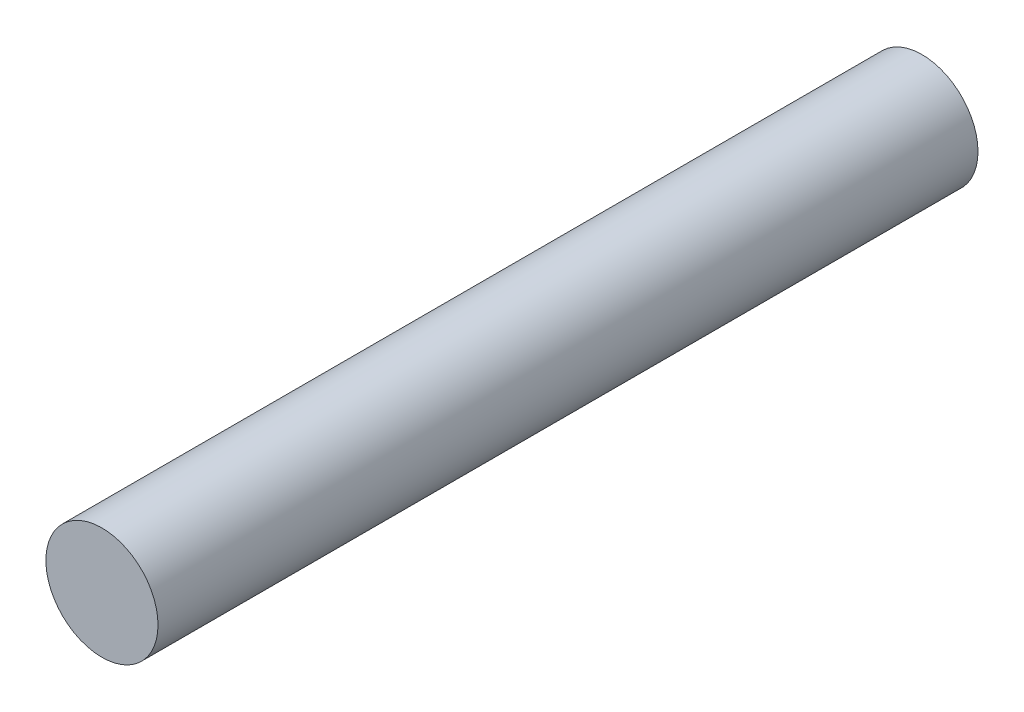
ISO-10303-21;
HEADER;
FILE_DESCRIPTION(('STEP AP214'),'2;1');
FILE_NAME('part.step','',(''),(''),'','','');
FILE_SCHEMA(('AUTOMOTIVE_DESIGN { 1 0 10303 214 1 1 1 1 }'));
ENDSEC;
DATA;
#1=APPLICATION_CONTEXT('core data for automotive mechanical design processes');
#2=APPLICATION_PROTOCOL_DEFINITION('international standard','automotive_design',2000,#1);
#3=PRODUCT_CONTEXT('',#1,'mechanical');
#4=PRODUCT('Part','Part','',(#3));
#5=PRODUCT_RELATED_PRODUCT_CATEGORY('part','',(#4));
#6=PRODUCT_DEFINITION_FORMATION('','',#4);
#7=PRODUCT_DEFINITION_CONTEXT('part definition',#1,'design');
#8=PRODUCT_DEFINITION('design','',#6,#7);
#9=PRODUCT_DEFINITION_SHAPE('','',#8);
#10=(LENGTH_UNIT() NAMED_UNIT(*) SI_UNIT(.MILLI.,.METRE.));
#11=(NAMED_UNIT(*) PLANE_ANGLE_UNIT() SI_UNIT($,.RADIAN.));
#12=(NAMED_UNIT(*) SI_UNIT($,.STERADIAN.) SOLID_ANGLE_UNIT());
#13=UNCERTAINTY_MEASURE_WITH_UNIT(LENGTH_MEASURE(1.E-05),#10,'distance_accuracy_value','');
#14=(GEOMETRIC_REPRESENTATION_CONTEXT(3) GLOBAL_UNCERTAINTY_ASSIGNED_CONTEXT((#13)) GLOBAL_UNIT_ASSIGNED_CONTEXT((#10,
#11,#12)) REPRESENTATION_CONTEXT('',''));
#15=CARTESIAN_POINT('',(0.,0.,0.));
#16=DIRECTION('',(0.,0.,1.));
#17=DIRECTION('',(1.,0.,0.));
#18=AXIS2_PLACEMENT_3D('',#15,#16,#17);
#19=CARTESIAN_POINT('',(0.,0.,17.4625));
#20=DIRECTION('',(0.,0.,-1.));
#21=DIRECTION('',(-1.,0.,0.));
#22=AXIS2_PLACEMENT_3D('',#19,#20,#21);
#23=CYLINDRICAL_SURFACE('',#22,2.3876);
#24=CARTESIAN_POINT('',(0.,0.,17.4625));
#25=DIRECTION('',(0.,0.,1.));
#26=DIRECTION('',(1.,0.,0.));
#27=AXIS2_PLACEMENT_3D('',#24,#25,#26);
#28=CIRCLE('',#27,2.3876);
#29=CARTESIAN_POINT('',(2.3876,0.,17.4625));
#30=VERTEX_POINT('',#29);
#31=EDGE_CURVE('E10',#30,#30,#28,.T.);
#32=ORIENTED_EDGE('',*,*,#31,.F.);
#33=EDGE_LOOP('',(#32));
#34=FACE_BOUND('',#33,.T.);
#35=CARTESIAN_POINT('',(0.,0.,-17.4625));
#36=DIRECTION('',(0.,0.,1.));
#37=DIRECTION('',(1.,0.,0.));
#38=AXIS2_PLACEMENT_3D('',#35,#36,#37);
#39=CIRCLE('',#38,2.3876);
#40=CARTESIAN_POINT('',(2.3876,0.,-17.4625));
#41=VERTEX_POINT('',#40);
#42=EDGE_CURVE('E40',#41,#41,#39,.T.);
#43=ORIENTED_EDGE('',*,*,#42,.T.);
#44=EDGE_LOOP('',(#43));
#45=FACE_BOUND('',#44,.T.);
#46=ADVANCED_FACE('F34',(#34,#45),#23,.T.);
#47=CARTESIAN_POINT('',(0.,0.,17.4625));
#48=DIRECTION('',(0.,0.,1.));
#49=DIRECTION('',(1.,0.,0.));
#50=AXIS2_PLACEMENT_3D('',#47,#48,#49);
#51=PLANE('',#50);
#52=ORIENTED_EDGE('',*,*,#31,.T.);
#53=EDGE_LOOP('',(#52));
#54=FACE_BOUND('',#53,.T.);
#55=ADVANCED_FACE('F49',(#54),#51,.T.);
#56=CARTESIAN_POINT('',(0.,0.,-17.4625));
#57=DIRECTION('',(0.,0.,1.));
#58=DIRECTION('',(1.,0.,0.));
#59=AXIS2_PLACEMENT_3D('',#56,#57,#58);
#60=PLANE('',#59);
#61=ORIENTED_EDGE('',*,*,#42,.F.);
#62=EDGE_LOOP('',(#61));
#63=FACE_BOUND('',#62,.T.);
#64=ADVANCED_FACE('F47',(#63),#60,.F.);
#65=CLOSED_SHELL('',(#46,#55,#64));
#66=MANIFOLD_SOLID_BREP('B2',#65);
#67=ADVANCED_BREP_SHAPE_REPRESENTATION('',(#18,#66),#14);
#68=SHAPE_DEFINITION_REPRESENTATION(#9,#67);
ENDSEC;
END-ISO-10303-21;
